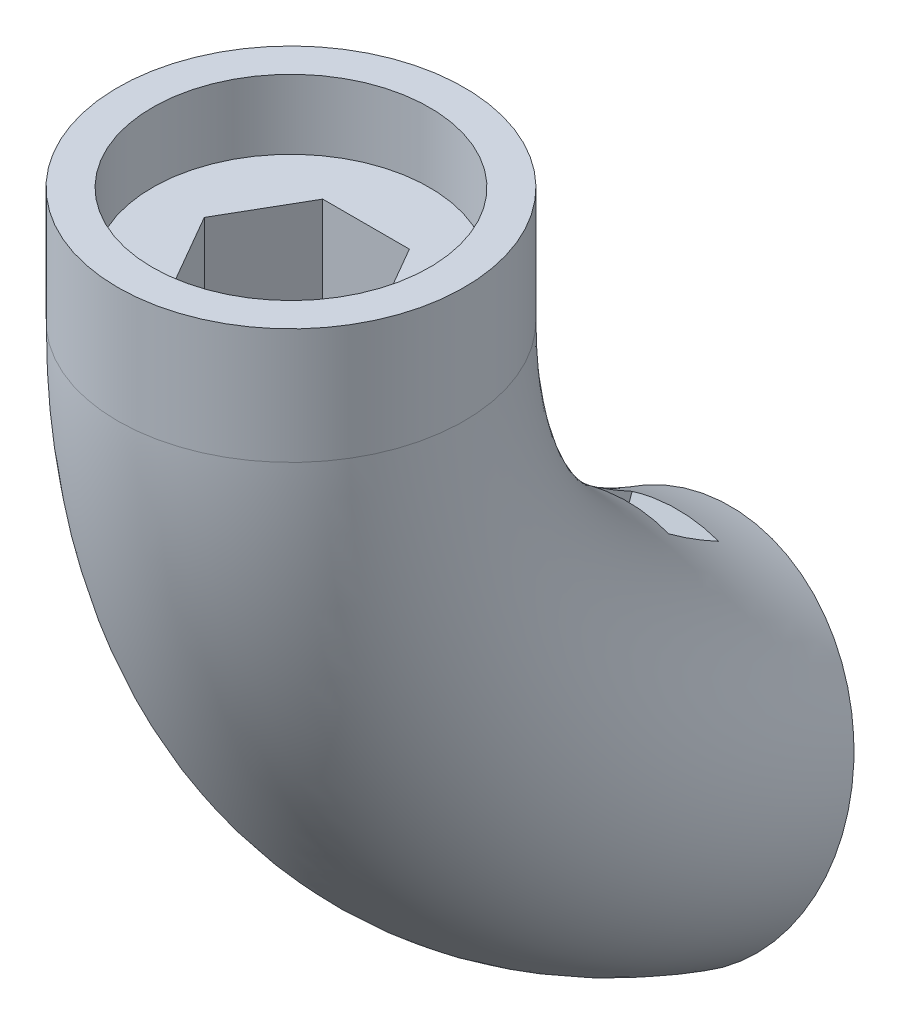
ISO-10303-21;
HEADER;
FILE_DESCRIPTION(('STEP AP214'),'2;1');
FILE_NAME('part.step','',(''),(''),'','','');
FILE_SCHEMA(('AUTOMOTIVE_DESIGN { 1 0 10303 214 1 1 1 1 }'));
ENDSEC;
DATA;
#1=APPLICATION_CONTEXT('core data for automotive mechanical design processes');
#2=APPLICATION_PROTOCOL_DEFINITION('international standard','automotive_design',2000,#1);
#3=PRODUCT_CONTEXT('',#1,'mechanical');
#4=PRODUCT('Part','Part','',(#3));
#5=PRODUCT_RELATED_PRODUCT_CATEGORY('part','',(#4));
#6=PRODUCT_DEFINITION_FORMATION('','',#4);
#7=PRODUCT_DEFINITION_CONTEXT('part definition',#1,'design');
#8=PRODUCT_DEFINITION('design','',#6,#7);
#9=PRODUCT_DEFINITION_SHAPE('','',#8);
#10=(LENGTH_UNIT() NAMED_UNIT(*) SI_UNIT(.MILLI.,.METRE.));
#11=(NAMED_UNIT(*) PLANE_ANGLE_UNIT() SI_UNIT($,.RADIAN.));
#12=(NAMED_UNIT(*) SI_UNIT($,.STERADIAN.) SOLID_ANGLE_UNIT());
#13=UNCERTAINTY_MEASURE_WITH_UNIT(LENGTH_MEASURE(1.E-05),#10,'distance_accuracy_value','');
#14=(GEOMETRIC_REPRESENTATION_CONTEXT(3) GLOBAL_UNCERTAINTY_ASSIGNED_CONTEXT((#13)) GLOBAL_UNIT_ASSIGNED_CONTEXT((#10,
#11,#12)) REPRESENTATION_CONTEXT('',''));
#15=CARTESIAN_POINT('',(0.,0.,0.));
#16=DIRECTION('',(0.,0.,1.));
#17=DIRECTION('',(1.,0.,0.));
#18=AXIS2_PLACEMENT_3D('',#15,#16,#17);
#19=CARTESIAN_POINT('',(0.,-122.217954291459,-21.4499457659036));
#20=DIRECTION('',(0.,-0.342020143325666,-0.939692620785909));
#21=DIRECTION('',(0.,0.939692620785909,-0.342020143325666));
#22=AXIS2_PLACEMENT_3D('',#19,#20,#21);
#23=CYLINDRICAL_SURFACE('',#22,2.24999999999999);
#24=CARTESIAN_POINT('',(0.,-125.638155724715,-30.8468719737627));
#25=DIRECTION('',(0.,-0.342020143325666,-0.93969262078591));
#26=DIRECTION('',(0.,0.939692620785909,-0.342020143325666));
#27=AXIS2_PLACEMENT_3D('',#24,#25,#26);
#28=CIRCLE('',#27,2.24999999999999);
#29=CARTESIAN_POINT('',(0.,-123.523847327947,-31.6164172962455));
#30=VERTEX_POINT('',#29);
#31=EDGE_CURVE('E312',#30,#30,#28,.T.);
#32=ORIENTED_EDGE('',*,*,#31,.T.);
#33=EDGE_LOOP('',(#32));
#34=FACE_BOUND('',#33,.T.);
#35=CARTESIAN_POINT('',(0.,-123.928055008087,-26.1484088698332));
#36=DIRECTION('',(0.,0.342020143325666,0.939692620785909));
#37=DIRECTION('',(0.,-0.939692620785909,0.342020143325666));
#38=AXIS2_PLACEMENT_3D('',#35,#36,#37);
#39=CIRCLE('',#38,2.24999999999999);
#40=CARTESIAN_POINT('',(0.,-126.042363404855,-25.3788635473505));
#41=VERTEX_POINT('',#40);
#42=EDGE_CURVE('E188',#41,#41,#39,.F.);
#43=ORIENTED_EDGE('',*,*,#42,.F.);
#44=EDGE_LOOP('',(#43));
#45=FACE_BOUND('',#44,.T.);
#46=ADVANCED_FACE('F78',(#34,#45),#23,.F.);
#47=CARTESIAN_POINT('',(0.,-110.941642842028,-25.5541874858116));
#48=DIRECTION('',(0.,-0.342020143325666,-0.939692620785909));
#49=DIRECTION('',(0.,0.939692620785909,-0.342020143325666));
#50=AXIS2_PLACEMENT_3D('',#47,#48,#49);
#51=CYLINDRICAL_SURFACE('',#50,2.24999999999999);
#52=CARTESIAN_POINT('',(0.,-114.361844275285,-34.9511136936707));
#53=DIRECTION('',(0.,-0.342020143325666,-0.93969262078591));
#54=DIRECTION('',(0.,0.939692620785909,-0.342020143325666));
#55=AXIS2_PLACEMENT_3D('',#52,#53,#54);
#56=CIRCLE('',#55,2.24999999999999);
#57=CARTESIAN_POINT('',(0.,-112.247535878516,-35.7206590161535));
#58=VERTEX_POINT('',#57);
#59=EDGE_CURVE('E310',#58,#58,#56,.T.);
#60=ORIENTED_EDGE('',*,*,#59,.T.);
#61=EDGE_LOOP('',(#60));
#62=FACE_BOUND('',#61,.T.);
#63=CARTESIAN_POINT('',(0.,-112.651743558656,-30.2526505897412));
#64=DIRECTION('',(0.,0.342020143325666,0.939692620785909));
#65=DIRECTION('',(0.,-0.939692620785909,0.342020143325666));
#66=AXIS2_PLACEMENT_3D('',#63,#64,#65);
#67=CIRCLE('',#66,2.24999999999999);
#68=CARTESIAN_POINT('',(0.,-114.766051955425,-29.4831052672585));
#69=VERTEX_POINT('',#68);
#70=EDGE_CURVE('E186',#69,#69,#67,.F.);
#71=ORIENTED_EDGE('',*,*,#70,.F.);
#72=EDGE_LOOP('',(#71));
#73=FACE_BOUND('',#72,.T.);
#74=ADVANCED_FACE('F217',(#62,#73),#51,.F.);
#75=CARTESIAN_POINT('',(0.,-73.0153689607045,0.));
#76=DIRECTION('',(0.,1.,0.));
#77=DIRECTION('',(0.,0.,1.));
#78=AXIS2_PLACEMENT_3D('',#75,#76,#77);
#79=CYLINDRICAL_SURFACE('',#78,15.);
#80=CARTESIAN_POINT('',(0.,-73.0153689607045,0.));
#81=DIRECTION('',(0.,1.,0.));
#82=DIRECTION('',(0.,0.,1.));
#83=AXIS2_PLACEMENT_3D('',#80,#81,#82);
#84=CIRCLE('',#83,15.);
#85=CARTESIAN_POINT('',(0.,-73.0153689607045,15.));
#86=VERTEX_POINT('',#85);
#87=EDGE_CURVE('E286',#86,#86,#84,.T.);
#88=CARTESIAN_POINT('',(0.,-63.,0.));
#89=DIRECTION('',(0.,1.,0.));
#90=DIRECTION('',(0.,0.,1.));
#91=AXIS2_PLACEMENT_3D('',#88,#89,#90);
#92=CIRCLE('',#91,15.);
#93=CARTESIAN_POINT('',(0.,-63.,15.));
#94=VERTEX_POINT('',#93);
#95=EDGE_CURVE('E289',#94,#94,#92,.T.);
#96=CARTESIAN_POINT('',(0.,-73.0153689607045,15.));
#97=CARTESIAN_POINT('',(0.,-72.9110422006972,15.));
#98=CARTESIAN_POINT('',(0.,-72.8067154406899,15.));
#99=CARTESIAN_POINT('',(0.,-72.5980619206752,15.));
#100=CARTESIAN_POINT('',(0.,-72.4937351606679,15.));
#101=CARTESIAN_POINT('',(0.,-72.2850816406532,15.));
#102=CARTESIAN_POINT('',(0.,-72.1807548806458,15.));
#103=CARTESIAN_POINT('',(0.,-71.9721013606312,15.));
#104=CARTESIAN_POINT('',(0.,-71.8677746006238,15.));
#105=CARTESIAN_POINT('',(0.,-71.6591210806092,15.));
#106=CARTESIAN_POINT('',(0.,-71.5547943206018,15.));
#107=CARTESIAN_POINT('',(0.,-71.3461408005871,15.));
#108=CARTESIAN_POINT('',(0.,-71.2418140405798,15.));
#109=CARTESIAN_POINT('',(0.,-71.0331605205651,15.));
#110=CARTESIAN_POINT('',(0.,-70.9288337605578,15.));
#111=CARTESIAN_POINT('',(0.,-70.7201802405431,15.));
#112=CARTESIAN_POINT('',(0.,-70.6158534805358,15.));
#113=CARTESIAN_POINT('',(0.,-70.4071999605211,15.));
#114=CARTESIAN_POINT('',(0.,-70.3028732005137,15.));
#115=CARTESIAN_POINT('',(0.,-70.0942196804991,15.));
#116=CARTESIAN_POINT('',(0.,-69.9898929204917,15.));
#117=CARTESIAN_POINT('',(0.,-69.781239400477,15.));
#118=CARTESIAN_POINT('',(0.,-69.6769126404697,15.));
#119=CARTESIAN_POINT('',(0.,-69.468259120455,15.));
#120=CARTESIAN_POINT('',(0.,-69.3639323604477,15.));
#121=CARTESIAN_POINT('',(0.,-69.155278840433,15.));
#122=CARTESIAN_POINT('',(0.,-69.0509520804257,15.));
#123=CARTESIAN_POINT('',(0.,-68.842298560411,15.));
#124=CARTESIAN_POINT('',(0.,-68.7379718004037,15.));
#125=CARTESIAN_POINT('',(0.,-68.529318280389,15.));
#126=CARTESIAN_POINT('',(0.,-68.4249915203816,15.));
#127=CARTESIAN_POINT('',(0.,-68.216338000367,15.));
#128=CARTESIAN_POINT('',(0.,-68.1120112403596,15.));
#129=CARTESIAN_POINT('',(0.,-67.9033577203449,15.));
#130=CARTESIAN_POINT('',(0.,-67.7990309603376,15.));
#131=CARTESIAN_POINT('',(0.,-67.5903774403229,15.));
#132=CARTESIAN_POINT('',(0.,-67.4860506803156,15.));
#133=CARTESIAN_POINT('',(0.,-67.2773971603009,15.));
#134=CARTESIAN_POINT('',(0.,-67.1730704002936,15.));
#135=CARTESIAN_POINT('',(0.,-66.9644168802789,15.));
#136=CARTESIAN_POINT('',(0.,-66.8600901202716,15.));
#137=CARTESIAN_POINT('',(0.,-66.6514366002569,15.));
#138=CARTESIAN_POINT('',(0.,-66.5471098402495,15.));
#139=CARTESIAN_POINT('',(0.,-66.3384563202349,15.));
#140=CARTESIAN_POINT('',(0.,-66.2341295602275,15.));
#141=CARTESIAN_POINT('',(0.,-66.0254760402129,15.));
#142=CARTESIAN_POINT('',(0.,-65.9211492802055,15.));
#143=CARTESIAN_POINT('',(0.,-65.7124957601908,15.));
#144=CARTESIAN_POINT('',(0.,-65.6081690001835,15.));
#145=CARTESIAN_POINT('',(0.,-65.3995154801688,15.));
#146=CARTESIAN_POINT('',(0.,-65.2951887201615,15.));
#147=CARTESIAN_POINT('',(0.,-65.0865352001468,15.));
#148=CARTESIAN_POINT('',(0.,-64.9822084401395,15.));
#149=CARTESIAN_POINT('',(0.,-64.7735549201248,15.));
#150=CARTESIAN_POINT('',(0.,-64.6692281601174,15.));
#151=CARTESIAN_POINT('',(0.,-64.4605746401027,15.));
#152=CARTESIAN_POINT('',(0.,-64.3562478800954,15.));
#153=CARTESIAN_POINT('',(0.,-64.1475943600807,15.));
#154=CARTESIAN_POINT('',(0.,-64.0432676000734,15.));
#155=CARTESIAN_POINT('',(0.,-63.8346140800587,15.));
#156=CARTESIAN_POINT('',(0.,-63.7302873200514,15.));
#157=CARTESIAN_POINT('',(0.,-63.5216338000367,15.));
#158=CARTESIAN_POINT('',(0.,-63.4173070400294,15.));
#159=CARTESIAN_POINT('',(0.,-63.2086535200147,15.));
#160=CARTESIAN_POINT('',(0.,-63.1043267600074,15.));
#161=CARTESIAN_POINT('',(0.,-63.,15.));
#162=B_SPLINE_CURVE_WITH_KNOTS('',3,(#96,#97,#98,#99,#100,#101,#102,#103,#104,#105,#106,#107,
#108,#109,#110,#111,#112,#113,#114,#115,#116,#117,#118,#119,#120,#121,#122,#123,#124,#125,#126,
#127,#128,#129,#130,#131,#132,#133,#134,#135,#136,#137,#138,#139,#140,#141,#142,#143,#144,#145,
#146,#147,#148,#149,#150,#151,#152,#153,#154,#155,#156,#157,#158,#159,#160,#161),.UNSPECIFIED.,
.F.,.F.,(4,2,2,2,2,2,2,2,2,2,2,2,2,2,2,2,2,2,2,2,2,2,2,2,2,2,2,2,2,2,2,2,4),(0.,
0.312980280022024,0.625960560044034,0.938940840066058,1.25192112008807,1.56490140011009,
1.8778816801321,2.19086196015413,2.50384224017614,2.81682252019816,3.12980280022017,
3.44278308024219,3.7557633602642,4.06874364028623,4.38172392030824,4.69470420033026,
5.00768448035227,5.32066476037429,5.6336450403963,5.94662532041833,6.25960560044034,
6.57258588046236,6.88556616048437,7.1985464405064,7.5115267205284,7.82450700055043,
8.13748728057244,8.45046756059446,8.76344784061647,9.0764281206385,9.38940840066051,
9.70238868068253,10.0153689607045),.UNSPECIFIED.);
#163=EDGE_CURVE('BSEAM220',#86,#94,#162,.T.);
#164=ORIENTED_EDGE('',*,*,#87,.T.);
#165=ORIENTED_EDGE('',*,*,#95,.F.);
#166=ORIENTED_EDGE('',*,*,#163,.T.);
#167=ORIENTED_EDGE('',*,*,#163,.F.);
#168=EDGE_LOOP('',(#164,#166,#165,#167));
#169=FACE_BOUND('',#168,.T.);
#170=ADVANCED_FACE('F220',(#169),#79,.T.);
#171=CARTESIAN_POINT('',(0.,-73.0153689607045,-50.));
#172=DIRECTION('',(1.,0.,0.));
#173=DIRECTION('',(0.,0.,-1.));
#174=AXIS2_PLACEMENT_3D('',#171,#172,#173);
#175=TOROIDAL_SURFACE('',#174,50.,15.);
#176=CARTESIAN_POINT('',(3.75,-73.0153689607045,-50.));
#177=DIRECTION('',(-1.,0.,0.));
#178=DIRECTION('',(0.,-1.,0.));
#179=AXIS2_PLACEMENT_3D('',#176,#177,#178);
#180=CIRCLE('',#179,35.4763124517222);
#181=CARTESIAN_POINT('',(3.74999999997356,-104.309337899316,-33.2890379319151));
#182=VERTEX_POINT('',#181);
#183=CARTESIAN_POINT('',(3.75,-101.580194449292,-28.9614760503868));
#184=VERTEX_POINT('',#183);
#185=EDGE_CURVE('E87',#182,#184,#180,.T.);
#186=ORIENTED_EDGE('',*,*,#185,.T.);
#187=CARTESIAN_POINT('',(3.75019999999984,-101.580245027113,-28.9614576415655));
#188=CARTESIAN_POINT('',(3.55218632888797,-101.530168047188,-28.9796841716801));
#189=CARTESIAN_POINT('',(3.35306951574436,-101.484034322254,-28.9964754743518));
#190=CARTESIAN_POINT('',(2.95292870580963,-101.399744270132,-29.027154544369));
#191=CARTESIAN_POINT('',(2.75190466979603,-101.361588107377,-29.0410422518655));
#192=CARTESIAN_POINT('',(2.14640230893295,-101.259220014006,-29.0783011907913));
#193=CARTESIAN_POINT('',(1.73952365778942,-101.207116051262,-29.0972654823173));
#194=CARTESIAN_POINT('',(0.931448717672906,-101.136529291564,-29.1229569617808));
#195=CARTESIAN_POINT('',(0.530320526608365,-101.117341948138,-29.1299405836623));
#196=CARTESIAN_POINT('',(-0.272133579509714,-101.1105798845,-29.132401773549));
#197=CARTESIAN_POINT('',(-0.673459344133318,-101.122992090659,-29.1278840999653));
#198=CARTESIAN_POINT('',(-1.29807372608765,-101.166925452655,-29.1118936639076));
#199=CARTESIAN_POINT('',(-1.52228075334467,-101.187683609387,-29.1043383127389));
#200=CARTESIAN_POINT('',(-1.96937571860007,-101.239048245301,-29.0856431141725));
#201=CARTESIAN_POINT('',(-2.19226389754871,-101.269652865192,-29.0745039435009));
#202=CARTESIAN_POINT('',(-2.863770316005,-101.376971682596,-29.0354430883894));
#203=CARTESIAN_POINT('',(-3.30970508176094,-101.46880249461,-29.0020194062275));
#204=CARTESIAN_POINT('',(-3.75019999999984,-101.580245027113,-28.9614576415655));
#205=B_SPLINE_CURVE_WITH_KNOTS('',3,(#187,#188,#189,#190,#191,#192,#193,#194,#195,#196,#197,
#198,#199,#200,#201,#202,#203,#204),.UNSPECIFIED.,.F.,.F.,(4,2,2,2,2,2,2,2,4),(0.,
0.615080869693826,1.23017441620459,2.46045418487341,3.66405640310465,4.86716073801296,
5.54282104111875,6.21835383530005,7.58597124193789),.UNSPECIFIED.);
#206=CARTESIAN_POINT('',(-3.75,-101.580194449296,-28.9614760503851));
#207=VERTEX_POINT('',#206);
#208=EDGE_CURVE('E164',#184,#207,#205,.T.);
#209=ORIENTED_EDGE('',*,*,#208,.T.);
#210=CARTESIAN_POINT('',(-3.75,-73.0153689607045,-50.));
#211=DIRECTION('',(1.,0.,0.));
#212=DIRECTION('',(0.,1.,0.));
#213=AXIS2_PLACEMENT_3D('',#210,#211,#212);
#214=CIRCLE('',#213,35.4763124517222);
#215=CARTESIAN_POINT('',(-3.75,-104.309337899322,-33.2890379319127));
#216=VERTEX_POINT('',#215);
#217=EDGE_CURVE('E12',#207,#216,#214,.T.);
#218=ORIENTED_EDGE('',*,*,#217,.T.);
#219=CARTESIAN_POINT('',(3.7502,-104.309386915486,-33.2890200914879));
#220=CARTESIAN_POINT('',(3.54594416713871,-104.259326601418,-33.3072405557269));
#221=CARTESIAN_POINT('',(3.34058118488573,-104.213355427416,-33.3239726946977));
#222=CARTESIAN_POINT('',(2.92795726311246,-104.129664691309,-33.3544336315246));
#223=CARTESIAN_POINT('',(2.72069630012649,-104.091945231367,-33.3681623921962));
#224=CARTESIAN_POINT('',(2.09651057895146,-103.991269999768,-33.4048051798261));
#225=CARTESIAN_POINT('',(1.67722043081463,-103.940806551517,-33.4231723729076));
#226=CARTESIAN_POINT('',(0.84450561834727,-103.874345489437,-33.4473622212427));
#227=CARTESIAN_POINT('',(0.431142694616597,-103.857646323216,-33.453440220684));
#228=CARTESIAN_POINT('',(-0.395511289401491,-103.856724761001,-33.4537756418994));
#229=CARTESIAN_POINT('',(-0.808802301235331,-103.872488073298,-33.4480382654299));
#230=CARTESIAN_POINT('',(-1.43282170092044,-103.920851818899,-33.4304353016136));
#231=CARTESIAN_POINT('',(-1.64466535374066,-103.941592713652,-33.4228862332914));
#232=CARTESIAN_POINT('',(-2.06717198281469,-103.991608379904,-33.4046820195286));
#233=CARTESIAN_POINT('',(-2.27783518808752,-104.020881433215,-33.3940274994574));
#234=CARTESIAN_POINT('',(-2.91214739722745,-104.122146782067,-33.3571699267127));
#235=CARTESIAN_POINT('',(-3.33347211327561,-104.207225940722,-33.3262036454059));
#236=CARTESIAN_POINT('',(-3.7502,-104.309386915486,-33.2890200914879));
#237=B_SPLINE_CURVE_WITH_KNOTS('',3,(#219,#220,#221,#222,#223,#224,#225,#226,#227,#228,#229,
#230,#231,#232,#233,#234,#235,#236),.UNSPECIFIED.,.F.,.F.,(4,2,2,2,2,2,2,2,4),(0.,
0.633164619095461,1.26633707691786,2.53279769717921,3.7726616950337,5.01197995556822,
5.65078408596001,6.28945966409561,7.58074845260003),.UNSPECIFIED.);
#238=EDGE_CURVE('E191',#182,#216,#237,.T.);
#239=ORIENTED_EDGE('',*,*,#238,.F.);
#240=EDGE_LOOP('',(#186,#209,#218,#239));
#241=FACE_BOUND('',#240,.T.);
#242=ORIENTED_EDGE('',*,*,#87,.F.);
#243=EDGE_LOOP('',(#242));
#244=FACE_BOUND('',#243,.T.);
#245=CARTESIAN_POINT('',(0.,-120.,-32.8989928337167));
#246=DIRECTION('',(0.,0.342020143325666,0.939692620785909));
#247=DIRECTION('',(0.,-0.939692620785909,0.342020143325666));
#248=AXIS2_PLACEMENT_3D('',#245,#246,#247);
#249=CIRCLE('',#248,15.);
#250=CARTESIAN_POINT('',(0.,-134.095389311789,-27.7686906838317));
#251=VERTEX_POINT('',#250);
#252=EDGE_CURVE('E293',#251,#251,#249,.T.);
#253=ORIENTED_EDGE('',*,*,#252,.T.);
#254=EDGE_LOOP('',(#253));
#255=FACE_BOUND('',#254,.T.);
#256=ADVANCED_FACE('F80',(#241,#244,#255),#175,.T.);
#257=CARTESIAN_POINT('',(0.,-63.,0.));
#258=DIRECTION('',(0.,1.,0.));
#259=DIRECTION('',(0.,0.,1.));
#260=AXIS2_PLACEMENT_3D('',#257,#258,#259);
#261=PLANE('',#260);
#262=CARTESIAN_POINT('',(0.,-63.,0.));
#263=DIRECTION('',(0.,1.,0.));
#264=DIRECTION('',(0.,0.,1.));
#265=AXIS2_PLACEMENT_3D('',#262,#263,#264);
#266=CIRCLE('',#265,12.);
#267=CARTESIAN_POINT('',(0.,-63.,12.));
#268=VERTEX_POINT('',#267);
#269=EDGE_CURVE('E315',#268,#268,#266,.T.);
#270=ORIENTED_EDGE('',*,*,#269,.F.);
#271=EDGE_LOOP('',(#270));
#272=FACE_BOUND('',#271,.T.);
#273=ORIENTED_EDGE('',*,*,#95,.T.);
#274=EDGE_LOOP('',(#273));
#275=FACE_BOUND('',#274,.T.);
#276=ADVANCED_FACE('F235',(#272,#275),#261,.T.);
#277=CARTESIAN_POINT('',(0.,-69.,0.));
#278=DIRECTION('',(0.,1.,0.));
#279=DIRECTION('',(0.,0.,1.));
#280=AXIS2_PLACEMENT_3D('',#277,#278,#279);
#281=PLANE('',#280);
#282=CARTESIAN_POINT('',(0.,-69.,0.));
#283=DIRECTION('',(0.,1.,0.));
#284=DIRECTION('',(0.,0.,1.));
#285=AXIS2_PLACEMENT_3D('',#282,#283,#284);
#286=CIRCLE('',#285,12.);
#287=CARTESIAN_POINT('',(0.,-69.,12.));
#288=VERTEX_POINT('',#287);
#289=EDGE_CURVE('E318',#288,#288,#286,.T.);
#290=ORIENTED_EDGE('',*,*,#289,.T.);
#291=EDGE_LOOP('',(#290));
#292=FACE_BOUND('',#291,.T.);
#293=DIRECTION('',(-0.5,0.,-0.866025403784439));
#294=VECTOR('',#293,1.);
#295=CARTESIAN_POINT('',(-7.50555349946513,-69.,0.));
#296=LINE('',#295,#294);
#297=CARTESIAN_POINT('',(-3.75277674973257,-69.,6.5));
#298=VERTEX_POINT('',#297);
#299=CARTESIAN_POINT('',(-7.50555349946513,-69.,0.));
#300=VERTEX_POINT('',#299);
#301=EDGE_CURVE('E330',#298,#300,#296,.T.);
#302=ORIENTED_EDGE('',*,*,#301,.T.);
#303=DIRECTION('',(0.5,0.,-0.866025403784439));
#304=VECTOR('',#303,1.);
#305=CARTESIAN_POINT('',(-3.75277674973257,-69.,-6.5));
#306=LINE('',#305,#304);
#307=CARTESIAN_POINT('',(-3.75277674973257,-69.,-6.5));
#308=VERTEX_POINT('',#307);
#309=EDGE_CURVE('E328',#300,#308,#306,.T.);
#310=ORIENTED_EDGE('',*,*,#309,.T.);
#311=DIRECTION('',(1.,0.,0.));
#312=VECTOR('',#311,1.);
#313=CARTESIAN_POINT('',(3.75277674973257,-69.,-6.5));
#314=LINE('',#313,#312);
#315=CARTESIAN_POINT('',(3.75277674973257,-69.,-6.5));
#316=VERTEX_POINT('',#315);
#317=EDGE_CURVE('E326',#308,#316,#314,.T.);
#318=ORIENTED_EDGE('',*,*,#317,.T.);
#319=DIRECTION('',(0.5,0.,0.866025403784439));
#320=VECTOR('',#319,1.);
#321=CARTESIAN_POINT('',(7.50555349946514,-69.,0.));
#322=LINE('',#321,#320);
#323=CARTESIAN_POINT('',(7.50555349946514,-69.,0.));
#324=VERTEX_POINT('',#323);
#325=EDGE_CURVE('E324',#316,#324,#322,.T.);
#326=ORIENTED_EDGE('',*,*,#325,.T.);
#327=DIRECTION('',(-0.5,0.,0.866025403784439));
#328=VECTOR('',#327,1.);
#329=CARTESIAN_POINT('',(3.75277674973257,-69.,6.5));
#330=LINE('',#329,#328);
#331=CARTESIAN_POINT('',(3.75277674973257,-69.,6.5));
#332=VERTEX_POINT('',#331);
#333=EDGE_CURVE('E102',#324,#332,#330,.T.);
#334=ORIENTED_EDGE('',*,*,#333,.T.);
#335=DIRECTION('',(-1.,0.,0.));
#336=VECTOR('',#335,1.);
#337=CARTESIAN_POINT('',(-3.75277674973257,-69.,6.5));
#338=LINE('',#337,#336);
#339=EDGE_CURVE('E304',#332,#298,#338,.T.);
#340=ORIENTED_EDGE('',*,*,#339,.T.);
#341=EDGE_LOOP('',(#302,#310,#318,#326,#334,#340));
#342=FACE_BOUND('',#341,.T.);
#343=ADVANCED_FACE('F231',(#292,#342),#281,.T.);
#344=CARTESIAN_POINT('',(0.,-69.,0.));
#345=DIRECTION('',(0.,1.,0.));
#346=DIRECTION('',(0.,0.,1.));
#347=AXIS2_PLACEMENT_3D('',#344,#345,#346);
#348=CYLINDRICAL_SURFACE('',#347,12.);
#349=ORIENTED_EDGE('',*,*,#289,.F.);
#350=EDGE_LOOP('',(#349));
#351=FACE_BOUND('',#350,.T.);
#352=ORIENTED_EDGE('',*,*,#269,.T.);
#353=EDGE_LOOP('',(#352));
#354=FACE_BOUND('',#353,.T.);
#355=ADVANCED_FACE('F234',(#351,#354),#348,.F.);
#356=CARTESIAN_POINT('',(0.,-93.,0.));
#357=DIRECTION('',(0.,1.,0.));
#358=DIRECTION('',(0.,0.,1.));
#359=AXIS2_PLACEMENT_3D('',#356,#357,#358);
#360=PLANE('',#359);
#361=CARTESIAN_POINT('',(0.,-93.,0.));
#362=DIRECTION('',(0.,1.,0.));
#363=DIRECTION('',(0.,0.,1.));
#364=AXIS2_PLACEMENT_3D('',#361,#362,#363);
#365=CIRCLE('',#364,4.);
#366=CARTESIAN_POINT('',(0.,-93.,4.));
#367=VERTEX_POINT('',#366);
#368=EDGE_CURVE('E333',#367,#367,#365,.T.);
#369=ORIENTED_EDGE('',*,*,#368,.T.);
#370=EDGE_LOOP('',(#369));
#371=FACE_BOUND('',#370,.T.);
#372=ADVANCED_FACE('F239',(#371),#360,.T.);
#373=CARTESIAN_POINT('',(0.,-93.,0.));
#374=DIRECTION('',(0.,1.,0.));
#375=DIRECTION('',(0.,0.,1.));
#376=AXIS2_PLACEMENT_3D('',#373,#374,#375);
#377=CYLINDRICAL_SURFACE('',#376,4.);
#378=ORIENTED_EDGE('',*,*,#368,.F.);
#379=EDGE_LOOP('',(#378));
#380=FACE_BOUND('',#379,.T.);
#381=CARTESIAN_POINT('',(0.,-83.,0.));
#382=DIRECTION('',(0.,1.,0.));
#383=DIRECTION('',(0.,0.,1.));
#384=AXIS2_PLACEMENT_3D('',#381,#382,#383);
#385=CIRCLE('',#384,4.);
#386=CARTESIAN_POINT('',(0.,-83.,4.));
#387=VERTEX_POINT('',#386);
#388=EDGE_CURVE('E332',#387,#387,#385,.T.);
#389=ORIENTED_EDGE('',*,*,#388,.T.);
#390=EDGE_LOOP('',(#389));
#391=FACE_BOUND('',#390,.T.);
#392=ADVANCED_FACE('F243',(#380,#391),#377,.F.);
#393=CARTESIAN_POINT('',(0.,-83.,0.));
#394=DIRECTION('',(0.,1.,0.));
#395=DIRECTION('',(0.,0.,1.));
#396=AXIS2_PLACEMENT_3D('',#393,#394,#395);
#397=PLANE('',#396);
#398=ORIENTED_EDGE('',*,*,#388,.F.);
#399=EDGE_LOOP('',(#398));
#400=FACE_BOUND('',#399,.T.);
#401=DIRECTION('',(0.5,0.,0.866025403784439));
#402=VECTOR('',#401,1.);
#403=CARTESIAN_POINT('',(-7.50555349946513,-83.,0.));
#404=LINE('',#403,#402);
#405=CARTESIAN_POINT('',(-7.50555349946513,-83.,0.));
#406=VERTEX_POINT('',#405);
#407=CARTESIAN_POINT('',(-3.75277674973257,-83.,6.5));
#408=VERTEX_POINT('',#407);
#409=EDGE_CURVE('E336',#406,#408,#404,.T.);
#410=ORIENTED_EDGE('',*,*,#409,.T.);
#411=DIRECTION('',(1.,0.,0.));
#412=VECTOR('',#411,1.);
#413=CARTESIAN_POINT('',(-3.75277674973257,-83.,6.5));
#414=LINE('',#413,#412);
#415=CARTESIAN_POINT('',(3.75277674973257,-83.,6.5));
#416=VERTEX_POINT('',#415);
#417=EDGE_CURVE('E341',#408,#416,#414,.T.);
#418=ORIENTED_EDGE('',*,*,#417,.T.);
#419=DIRECTION('',(0.5,0.,-0.866025403784439));
#420=VECTOR('',#419,1.);
#421=CARTESIAN_POINT('',(3.75277674973257,-83.,6.5));
#422=LINE('',#421,#420);
#423=CARTESIAN_POINT('',(7.50555349946514,-83.,0.));
#424=VERTEX_POINT('',#423);
#425=EDGE_CURVE('E344',#416,#424,#422,.T.);
#426=ORIENTED_EDGE('',*,*,#425,.T.);
#427=DIRECTION('',(-0.5,0.,-0.866025403784438));
#428=VECTOR('',#427,1.);
#429=CARTESIAN_POINT('',(7.50555349946514,-83.,0.));
#430=LINE('',#429,#428);
#431=CARTESIAN_POINT('',(3.75277674973257,-83.,-6.5));
#432=VERTEX_POINT('',#431);
#433=EDGE_CURVE('E347',#424,#432,#430,.T.);
#434=ORIENTED_EDGE('',*,*,#433,.T.);
#435=DIRECTION('',(-1.,0.,0.));
#436=VECTOR('',#435,1.);
#437=CARTESIAN_POINT('',(3.75277674973257,-83.,-6.5));
#438=LINE('',#437,#436);
#439=CARTESIAN_POINT('',(-3.75277674973257,-83.,-6.5));
#440=VERTEX_POINT('',#439);
#441=EDGE_CURVE('E350',#432,#440,#438,.T.);
#442=ORIENTED_EDGE('',*,*,#441,.T.);
#443=DIRECTION('',(-0.5,0.,0.866025403784439));
#444=VECTOR('',#443,1.);
#445=CARTESIAN_POINT('',(-3.75277674973257,-83.,-6.5));
#446=LINE('',#445,#444);
#447=EDGE_CURVE('E353',#440,#406,#446,.T.);
#448=ORIENTED_EDGE('',*,*,#447,.T.);
#449=EDGE_LOOP('',(#410,#418,#426,#434,#442,#448));
#450=FACE_BOUND('',#449,.T.);
#451=ADVANCED_FACE('F247',(#400,#450),#397,.T.);
#452=CARTESIAN_POINT('',(-3.75277674973257,-83.,6.5));
#453=DIRECTION('',(0.,0.,1.));
#454=DIRECTION('',(1.,0.,0.));
#455=AXIS2_PLACEMENT_3D('',#452,#453,#454);
#456=PLANE('',#455);
#457=ORIENTED_EDGE('',*,*,#339,.F.);
#458=DIRECTION('',(0.,1.,0.));
#459=VECTOR('',#458,1.);
#460=CARTESIAN_POINT('',(3.75277674973257,-83.,6.5));
#461=LINE('',#460,#459);
#462=EDGE_CURVE('E363',#416,#332,#461,.T.);
#463=ORIENTED_EDGE('',*,*,#462,.F.);
#464=ORIENTED_EDGE('',*,*,#417,.F.);
#465=DIRECTION('',(0.,1.,0.));
#466=VECTOR('',#465,1.);
#467=CARTESIAN_POINT('',(-3.75277674973257,-83.,6.5));
#468=LINE('',#467,#466);
#469=EDGE_CURVE('E299',#408,#298,#468,.T.);
#470=ORIENTED_EDGE('',*,*,#469,.T.);
#471=EDGE_LOOP('',(#457,#463,#464,#470));
#472=FACE_BOUND('',#471,.T.);
#473=ADVANCED_FACE('F251',(#472),#456,.F.);
#474=CARTESIAN_POINT('',(3.75277674973257,-83.,6.5));
#475=DIRECTION('',(0.866025403784439,0.,0.5));
#476=DIRECTION('',(0.5,0.,-0.866025403784439));
#477=AXIS2_PLACEMENT_3D('',#474,#475,#476);
#478=PLANE('',#477);
#479=ORIENTED_EDGE('',*,*,#333,.F.);
#480=DIRECTION('',(0.,1.,0.));
#481=VECTOR('',#480,1.);
#482=CARTESIAN_POINT('',(7.50555349946514,-83.,0.));
#483=LINE('',#482,#481);
#484=EDGE_CURVE('E361',#424,#324,#483,.T.);
#485=ORIENTED_EDGE('',*,*,#484,.F.);
#486=ORIENTED_EDGE('',*,*,#425,.F.);
#487=ORIENTED_EDGE('',*,*,#462,.T.);
#488=EDGE_LOOP('',(#479,#485,#486,#487));
#489=FACE_BOUND('',#488,.T.);
#490=ADVANCED_FACE('F264',(#489),#478,.F.);
#491=CARTESIAN_POINT('',(7.50555349946514,-83.,0.));
#492=DIRECTION('',(0.866025403784438,0.,-0.5));
#493=DIRECTION('',(-0.5,0.,-0.866025403784439));
#494=AXIS2_PLACEMENT_3D('',#491,#492,#493);
#495=PLANE('',#494);
#496=ORIENTED_EDGE('',*,*,#325,.F.);
#497=DIRECTION('',(0.,1.,0.));
#498=VECTOR('',#497,1.);
#499=CARTESIAN_POINT('',(3.75277674973257,-83.,-6.5));
#500=LINE('',#499,#498);
#501=EDGE_CURVE('E358',#432,#316,#500,.T.);
#502=ORIENTED_EDGE('',*,*,#501,.F.);
#503=ORIENTED_EDGE('',*,*,#433,.F.);
#504=ORIENTED_EDGE('',*,*,#484,.T.);
#505=EDGE_LOOP('',(#496,#502,#503,#504));
#506=FACE_BOUND('',#505,.T.);
#507=ADVANCED_FACE('F260',(#506),#495,.F.);
#508=CARTESIAN_POINT('',(3.75277674973257,-83.,-6.5));
#509=DIRECTION('',(0.,0.,-1.));
#510=DIRECTION('',(-1.,0.,0.));
#511=AXIS2_PLACEMENT_3D('',#508,#509,#510);
#512=PLANE('',#511);
#513=ORIENTED_EDGE('',*,*,#317,.F.);
#514=DIRECTION('',(0.,1.,0.));
#515=VECTOR('',#514,1.);
#516=CARTESIAN_POINT('',(-3.75277674973257,-83.,-6.5));
#517=LINE('',#516,#515);
#518=EDGE_CURVE('E296',#440,#308,#517,.T.);
#519=ORIENTED_EDGE('',*,*,#518,.F.);
#520=ORIENTED_EDGE('',*,*,#441,.F.);
#521=ORIENTED_EDGE('',*,*,#501,.T.);
#522=EDGE_LOOP('',(#513,#519,#520,#521));
#523=FACE_BOUND('',#522,.T.);
#524=ADVANCED_FACE('F256',(#523),#512,.F.);
#525=CARTESIAN_POINT('',(-3.75277674973257,-83.,-6.5));
#526=DIRECTION('',(-0.866025403784439,0.,-0.5));
#527=DIRECTION('',(-0.5,0.,0.866025403784439));
#528=AXIS2_PLACEMENT_3D('',#525,#526,#527);
#529=PLANE('',#528);
#530=ORIENTED_EDGE('',*,*,#309,.F.);
#531=DIRECTION('',(0.,1.,0.));
#532=VECTOR('',#531,1.);
#533=CARTESIAN_POINT('',(-7.50555349946513,-83.,0.));
#534=LINE('',#533,#532);
#535=EDGE_CURVE('E291',#406,#300,#534,.T.);
#536=ORIENTED_EDGE('',*,*,#535,.F.);
#537=ORIENTED_EDGE('',*,*,#447,.F.);
#538=ORIENTED_EDGE('',*,*,#518,.T.);
#539=EDGE_LOOP('',(#530,#536,#537,#538));
#540=FACE_BOUND('',#539,.T.);
#541=ADVANCED_FACE('F253',(#540),#529,.F.);
#542=CARTESIAN_POINT('',(-7.50555349946513,-83.,0.));
#543=DIRECTION('',(-0.866025403784439,0.,0.5));
#544=DIRECTION('',(0.5,0.,0.866025403784439));
#545=AXIS2_PLACEMENT_3D('',#542,#543,#544);
#546=PLANE('',#545);
#547=ORIENTED_EDGE('',*,*,#301,.F.);
#548=ORIENTED_EDGE('',*,*,#469,.F.);
#549=ORIENTED_EDGE('',*,*,#409,.F.);
#550=ORIENTED_EDGE('',*,*,#535,.T.);
#551=EDGE_LOOP('',(#547,#548,#549,#550));
#552=FACE_BOUND('',#551,.T.);
#553=ADVANCED_FACE('F229',(#552),#546,.F.);
#554=CARTESIAN_POINT('',(55.,-94.0644836663089,-42.3387487895051));
#555=DIRECTION('',(0.,-0.342020143325666,-0.939692620785909));
#556=DIRECTION('',(0.,0.93969262078591,-0.342020143325666));
#557=AXIS2_PLACEMENT_3D('',#554,#555,#556);
#558=PLANE('',#557);
#559=ORIENTED_EDGE('',*,*,#59,.F.);
#560=EDGE_LOOP('',(#559));
#561=FACE_BOUND('',#560,.T.);
#562=ORIENTED_EDGE('',*,*,#31,.F.);
#563=EDGE_LOOP('',(#562));
#564=FACE_BOUND('',#563,.T.);
#565=ORIENTED_EDGE('',*,*,#252,.F.);
#566=EDGE_LOOP('',(#565));
#567=FACE_BOUND('',#566,.T.);
#568=ADVANCED_FACE('F211',(#561,#564,#567),#558,.T.);
#569=CARTESIAN_POINT('',(-3.75,-90.504455248843,-32.9927154418454));
#570=DIRECTION('',(-1.,0.,0.));
#571=DIRECTION('',(0.,-1.,0.));
#572=AXIS2_PLACEMENT_3D('',#569,#570,#571);
#573=PLANE('',#572);
#574=DIRECTION('',(0.,0.939692620785909,-0.342020143325666));
#575=VECTOR('',#574,1.);
#576=CARTESIAN_POINT('',(-3.75,-90.504455248843,-32.9927154418454));
#577=LINE('',#576,#575);
#578=CARTESIAN_POINT('',(-3.75,-126.916417395388,-19.7398450492753));
#579=VERTEX_POINT('',#578);
#580=EDGE_CURVE('E175',#579,#207,#577,.T.);
#581=ORIENTED_EDGE('',*,*,#580,.F.);
#582=DIRECTION('',(0.,-0.342020143325666,-0.939692620785909));
#583=VECTOR('',#582,1.);
#584=CARTESIAN_POINT('',(-3.75,-126.916417395388,-19.7398450492753));
#585=LINE('',#584,#583);
#586=CARTESIAN_POINT('',(-3.75,-128.626518112017,-24.4383081532048));
#587=VERTEX_POINT('',#586);
#588=EDGE_CURVE('E174',#579,#587,#585,.T.);
#589=ORIENTED_EDGE('',*,*,#588,.T.);
#590=DIRECTION('',(0.,0.939692620785909,-0.342020143325666));
#591=VECTOR('',#590,1.);
#592=CARTESIAN_POINT('',(-3.75,-92.2145559654713,-37.691178545775));
#593=LINE('',#592,#591);
#594=EDGE_CURVE('E167',#587,#216,#593,.T.);
#595=ORIENTED_EDGE('',*,*,#594,.T.);
#596=ORIENTED_EDGE('',*,*,#217,.F.);
#597=EDGE_LOOP('',(#581,#589,#595,#596));
#598=FACE_BOUND('',#597,.T.);
#599=ADVANCED_FACE('F208',(#598),#573,.F.);
#600=CARTESIAN_POINT('',(3.75,-90.504455248843,-32.9927154418454));
#601=DIRECTION('',(1.,0.,0.));
#602=DIRECTION('',(0.,1.,0.));
#603=AXIS2_PLACEMENT_3D('',#600,#601,#602);
#604=PLANE('',#603);
#605=DIRECTION('',(0.,-0.939692620785909,0.342020143325666));
#606=VECTOR('',#605,1.);
#607=CARTESIAN_POINT('',(3.75,-92.2145559654713,-37.691178545775));
#608=LINE('',#607,#606);
#609=CARTESIAN_POINT('',(3.75,-128.626518112017,-24.4383081532048));
#610=VERTEX_POINT('',#609);
#611=EDGE_CURVE('E94',#182,#610,#608,.T.);
#612=ORIENTED_EDGE('',*,*,#611,.T.);
#613=DIRECTION('',(0.,-0.342020143325666,-0.939692620785909));
#614=VECTOR('',#613,1.);
#615=CARTESIAN_POINT('',(3.75,-126.916417395388,-19.7398450492753));
#616=LINE('',#615,#614);
#617=CARTESIAN_POINT('',(3.75,-126.916417395388,-19.7398450492753));
#618=VERTEX_POINT('',#617);
#619=EDGE_CURVE('E170',#618,#610,#616,.T.);
#620=ORIENTED_EDGE('',*,*,#619,.F.);
#621=DIRECTION('',(0.,-0.939692620785909,0.342020143325666));
#622=VECTOR('',#621,1.);
#623=CARTESIAN_POINT('',(3.75,-90.504455248843,-32.9927154418454));
#624=LINE('',#623,#622);
#625=EDGE_CURVE('E156',#184,#618,#624,.T.);
#626=ORIENTED_EDGE('',*,*,#625,.F.);
#627=ORIENTED_EDGE('',*,*,#185,.F.);
#628=EDGE_LOOP('',(#612,#620,#626,#627));
#629=FACE_BOUND('',#628,.T.);
#630=ADVANCED_FACE('F171',(#629),#604,.F.);
#631=CARTESIAN_POINT('',(0.,-22.9007651785724,-62.9193352163609));
#632=DIRECTION('',(0.,0.342020143325666,0.939692620785909));
#633=DIRECTION('',(0.,-0.939692620785909,0.342020143325666));
#634=AXIS2_PLACEMENT_3D('',#631,#632,#633);
#635=PLANE('',#634);
#636=ORIENTED_EDGE('',*,*,#42,.T.);
#637=EDGE_LOOP('',(#636));
#638=FACE_BOUND('',#637,.T.);
#639=ORIENTED_EDGE('',*,*,#70,.T.);
#640=EDGE_LOOP('',(#639));
#641=FACE_BOUND('',#640,.T.);
#642=ORIENTED_EDGE('',*,*,#238,.T.);
#643=ORIENTED_EDGE('',*,*,#594,.F.);
#644=DIRECTION('',(-1.,0.,0.));
#645=VECTOR('',#644,1.);
#646=CARTESIAN_POINT('',(3.75,-128.626518112017,-24.4383081532048));
#647=LINE('',#646,#645);
#648=EDGE_CURVE('E182',#610,#587,#647,.T.);
#649=ORIENTED_EDGE('',*,*,#648,.F.);
#650=ORIENTED_EDGE('',*,*,#611,.F.);
#651=EDGE_LOOP('',(#642,#643,#649,#650));
#652=FACE_BOUND('',#651,.T.);
#653=ADVANCED_FACE('F202',(#638,#641,#652),#635,.T.);
#654=CARTESIAN_POINT('',(3.75,-126.916417395388,-19.7398450492753));
#655=DIRECTION('',(0.,-0.939692620785909,0.342020143325666));
#656=DIRECTION('',(0.,-0.342020143325666,-0.939692620785909));
#657=AXIS2_PLACEMENT_3D('',#654,#655,#656);
#658=PLANE('',#657);
#659=ORIENTED_EDGE('',*,*,#648,.T.);
#660=ORIENTED_EDGE('',*,*,#588,.F.);
#661=DIRECTION('',(-1.,0.,0.));
#662=VECTOR('',#661,1.);
#663=CARTESIAN_POINT('',(3.75,-126.916417395388,-19.7398450492753));
#664=LINE('',#663,#662);
#665=EDGE_CURVE('E161',#618,#579,#664,.T.);
#666=ORIENTED_EDGE('',*,*,#665,.F.);
#667=ORIENTED_EDGE('',*,*,#619,.T.);
#668=EDGE_LOOP('',(#659,#660,#666,#667));
#669=FACE_BOUND('',#668,.T.);
#670=ADVANCED_FACE('F177',(#669),#658,.F.);
#671=CARTESIAN_POINT('',(0.,-122.217954291459,-21.4499457659036));
#672=DIRECTION('',(0.,-0.342020143325666,-0.93969262078591));
#673=DIRECTION('',(0.,0.939692620785909,-0.342020143325666));
#674=AXIS2_PLACEMENT_3D('',#671,#672,#673);
#675=PLANE('',#674);
#676=ORIENTED_EDGE('',*,*,#625,.T.);
#677=ORIENTED_EDGE('',*,*,#665,.T.);
#678=ORIENTED_EDGE('',*,*,#580,.T.);
#679=ORIENTED_EDGE('',*,*,#208,.F.);
#680=EDGE_LOOP('',(#676,#677,#678,#679));
#681=FACE_BOUND('',#680,.T.);
#682=ADVANCED_FACE('F158',(#681),#675,.T.);
#683=CLOSED_SHELL('',(#46,#74,#170,#256,#276,#343,#355,#372,#392,#451,#473,#490,#507,#524,#541,
#553,#568,#599,#630,#653,#670,#682));
#684=MANIFOLD_SOLID_BREP('B2',#683);
#685=ADVANCED_BREP_SHAPE_REPRESENTATION('',(#18,#684),#14);
#686=SHAPE_DEFINITION_REPRESENTATION(#9,#685);
ENDSEC;
END-ISO-10303-21;
